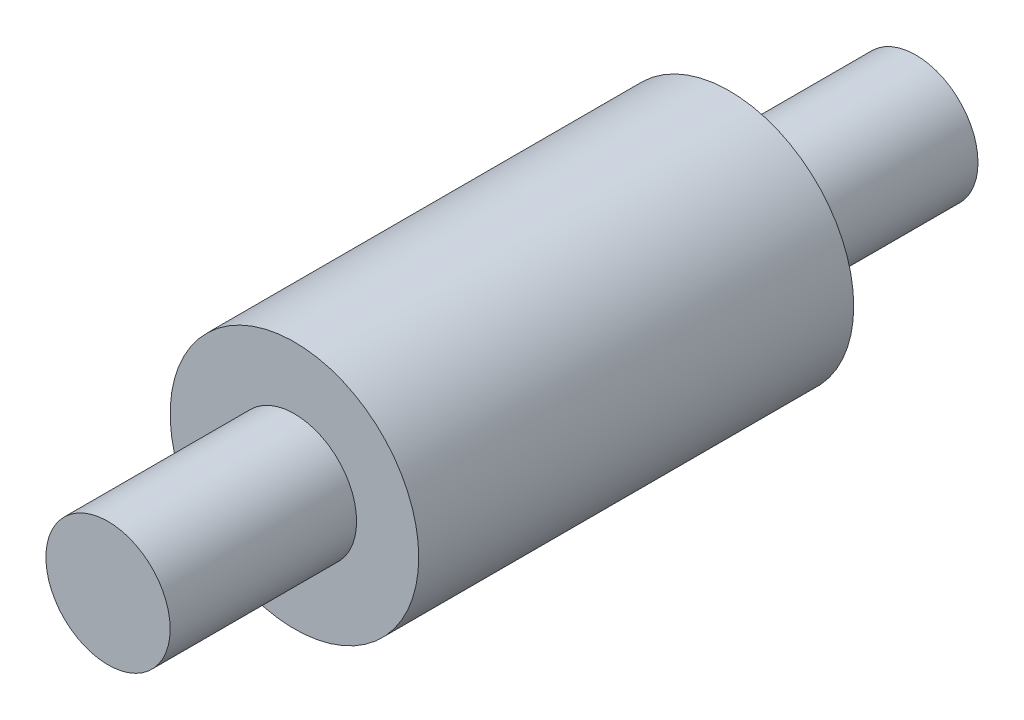
ISO-10303-21;
HEADER;
FILE_DESCRIPTION(('STEP AP214'),'2;1');
FILE_NAME('part.step','',(''),(''),'','','');
FILE_SCHEMA(('AUTOMOTIVE_DESIGN { 1 0 10303 214 1 1 1 1 }'));
ENDSEC;
DATA;
#1=APPLICATION_CONTEXT('core data for automotive mechanical design processes');
#2=APPLICATION_PROTOCOL_DEFINITION('international standard','automotive_design',2000,#1);
#3=PRODUCT_CONTEXT('',#1,'mechanical');
#4=PRODUCT('Part','Part','',(#3));
#5=PRODUCT_RELATED_PRODUCT_CATEGORY('part','',(#4));
#6=PRODUCT_DEFINITION_FORMATION('','',#4);
#7=PRODUCT_DEFINITION_CONTEXT('part definition',#1,'design');
#8=PRODUCT_DEFINITION('design','',#6,#7);
#9=PRODUCT_DEFINITION_SHAPE('','',#8);
#10=(LENGTH_UNIT() NAMED_UNIT(*) SI_UNIT(.MILLI.,.METRE.));
#11=(NAMED_UNIT(*) PLANE_ANGLE_UNIT() SI_UNIT($,.RADIAN.));
#12=(NAMED_UNIT(*) SI_UNIT($,.STERADIAN.) SOLID_ANGLE_UNIT());
#13=UNCERTAINTY_MEASURE_WITH_UNIT(LENGTH_MEASURE(1.E-05),#10,'distance_accuracy_value','');
#14=(GEOMETRIC_REPRESENTATION_CONTEXT(3) GLOBAL_UNCERTAINTY_ASSIGNED_CONTEXT((#13)) GLOBAL_UNIT_ASSIGNED_CONTEXT((#10,
#11,#12)) REPRESENTATION_CONTEXT('',''));
#15=CARTESIAN_POINT('',(0.,0.,0.));
#16=DIRECTION('',(0.,0.,1.));
#17=DIRECTION('',(1.,0.,0.));
#18=AXIS2_PLACEMENT_3D('',#15,#16,#17);
#19=CARTESIAN_POINT('',(0.,0.,0.));
#20=DIRECTION('',(0.,0.,-1.));
#21=DIRECTION('',(-1.,0.,0.));
#22=AXIS2_PLACEMENT_3D('',#19,#20,#21);
#23=PLANE('',#22);
#24=CARTESIAN_POINT('',(0.,0.,0.));
#25=DIRECTION('',(0.,0.,1.));
#26=DIRECTION('',(1.,0.,0.));
#27=AXIS2_PLACEMENT_3D('',#24,#25,#26);
#28=CIRCLE('',#27,10.);
#29=CARTESIAN_POINT('',(10.,0.,0.));
#30=VERTEX_POINT('',#29);
#31=EDGE_CURVE('E10',#30,#30,#28,.T.);
#32=ORIENTED_EDGE('',*,*,#31,.T.);
#33=EDGE_LOOP('',(#32));
#34=FACE_BOUND('',#33,.T.);
#35=ADVANCED_FACE('F31',(#34),#23,.F.);
#36=CARTESIAN_POINT('',(0.,0.,43.2423988439306));
#37=DIRECTION('',(0.,0.,1.));
#38=DIRECTION('',(1.,0.,0.));
#39=AXIS2_PLACEMENT_3D('',#36,#37,#38);
#40=CYLINDRICAL_SURFACE('',#39,10.);
#41=ORIENTED_EDGE('',*,*,#31,.F.);
#42=EDGE_LOOP('',(#41));
#43=FACE_BOUND('',#42,.T.);
#44=CARTESIAN_POINT('',(0.,0.,-30.));
#45=DIRECTION('',(0.,0.,1.));
#46=DIRECTION('',(1.,0.,0.));
#47=AXIS2_PLACEMENT_3D('',#44,#45,#46);
#48=CIRCLE('',#47,10.);
#49=CARTESIAN_POINT('',(10.,0.,-30.));
#50=VERTEX_POINT('',#49);
#51=EDGE_CURVE('E37',#50,#50,#48,.T.);
#52=ORIENTED_EDGE('',*,*,#51,.T.);
#53=EDGE_LOOP('',(#52));
#54=FACE_BOUND('',#53,.T.);
#55=ADVANCED_FACE('F69',(#43,#54),#40,.T.);
#56=CARTESIAN_POINT('',(0.,10.,-30.));
#57=DIRECTION('',(0.,0.,-1.));
#58=DIRECTION('',(-1.,0.,0.));
#59=AXIS2_PLACEMENT_3D('',#56,#57,#58);
#60=PLANE('',#59);
#61=ORIENTED_EDGE('',*,*,#51,.F.);
#62=EDGE_LOOP('',(#61));
#63=FACE_BOUND('',#62,.T.);
#64=CARTESIAN_POINT('',(0.,0.,-30.));
#65=DIRECTION('',(0.,0.,1.));
#66=DIRECTION('',(1.,0.,0.));
#67=AXIS2_PLACEMENT_3D('',#64,#65,#66);
#68=CIRCLE('',#67,20.);
#69=CARTESIAN_POINT('',(20.,0.,-30.));
#70=VERTEX_POINT('',#69);
#71=EDGE_CURVE('E41',#70,#70,#68,.T.);
#72=ORIENTED_EDGE('',*,*,#71,.T.);
#73=EDGE_LOOP('',(#72));
#74=FACE_BOUND('',#73,.T.);
#75=ADVANCED_FACE('F73',(#63,#74),#60,.F.);
#76=CARTESIAN_POINT('',(0.,0.,43.2423988439306));
#77=DIRECTION('',(0.,0.,1.));
#78=DIRECTION('',(1.,0.,0.));
#79=AXIS2_PLACEMENT_3D('',#76,#77,#78);
#80=CYLINDRICAL_SURFACE('',#79,20.);
#81=ORIENTED_EDGE('',*,*,#71,.F.);
#82=EDGE_LOOP('',(#81));
#83=FACE_BOUND('',#82,.T.);
#84=CARTESIAN_POINT('',(0.,0.,-100.));
#85=DIRECTION('',(0.,0.,1.));
#86=DIRECTION('',(1.,0.,0.));
#87=AXIS2_PLACEMENT_3D('',#84,#85,#86);
#88=CIRCLE('',#87,20.);
#89=CARTESIAN_POINT('',(20.,0.,-100.));
#90=VERTEX_POINT('',#89);
#91=EDGE_CURVE('E45',#90,#90,#88,.T.);
#92=ORIENTED_EDGE('',*,*,#91,.T.);
#93=EDGE_LOOP('',(#92));
#94=FACE_BOUND('',#93,.T.);
#95=ADVANCED_FACE('F78',(#83,#94),#80,.T.);
#96=CARTESIAN_POINT('',(0.,20.,-100.));
#97=DIRECTION('',(0.,0.,1.));
#98=DIRECTION('',(1.,0.,0.));
#99=AXIS2_PLACEMENT_3D('',#96,#97,#98);
#100=PLANE('',#99);
#101=ORIENTED_EDGE('',*,*,#91,.F.);
#102=EDGE_LOOP('',(#101));
#103=FACE_BOUND('',#102,.T.);
#104=CARTESIAN_POINT('',(0.,0.,-100.));
#105=DIRECTION('',(0.,0.,1.));
#106=DIRECTION('',(1.,0.,0.));
#107=AXIS2_PLACEMENT_3D('',#104,#105,#106);
#108=CIRCLE('',#107,10.);
#109=CARTESIAN_POINT('',(10.,0.,-100.));
#110=VERTEX_POINT('',#109);
#111=EDGE_CURVE('E50',#110,#110,#108,.T.);
#112=ORIENTED_EDGE('',*,*,#111,.T.);
#113=EDGE_LOOP('',(#112));
#114=FACE_BOUND('',#113,.T.);
#115=ADVANCED_FACE('F65',(#103,#114),#100,.F.);
#116=CARTESIAN_POINT('',(0.,0.,43.2423988439306));
#117=DIRECTION('',(0.,0.,1.));
#118=DIRECTION('',(1.,0.,0.));
#119=AXIS2_PLACEMENT_3D('',#116,#117,#118);
#120=CYLINDRICAL_SURFACE('',#119,10.);
#121=ORIENTED_EDGE('',*,*,#111,.F.);
#122=EDGE_LOOP('',(#121));
#123=FACE_BOUND('',#122,.T.);
#124=CARTESIAN_POINT('',(0.,0.,-130.));
#125=DIRECTION('',(0.,0.,1.));
#126=DIRECTION('',(1.,0.,0.));
#127=AXIS2_PLACEMENT_3D('',#124,#125,#126);
#128=CIRCLE('',#127,10.);
#129=CARTESIAN_POINT('',(10.,0.,-130.));
#130=VERTEX_POINT('',#129);
#131=EDGE_CURVE('E53',#130,#130,#128,.T.);
#132=ORIENTED_EDGE('',*,*,#131,.T.);
#133=EDGE_LOOP('',(#132));
#134=FACE_BOUND('',#133,.T.);
#135=ADVANCED_FACE('F57',(#123,#134),#120,.T.);
#136=CARTESIAN_POINT('',(0.,10.,-130.));
#137=DIRECTION('',(0.,0.,1.));
#138=DIRECTION('',(1.,0.,0.));
#139=AXIS2_PLACEMENT_3D('',#136,#137,#138);
#140=PLANE('',#139);
#141=ORIENTED_EDGE('',*,*,#131,.F.);
#142=EDGE_LOOP('',(#141));
#143=FACE_BOUND('',#142,.T.);
#144=ADVANCED_FACE('F59',(#143),#140,.F.);
#145=CLOSED_SHELL('',(#35,#55,#75,#95,#115,#135,#144));
#146=MANIFOLD_SOLID_BREP('B2',#145);
#147=ADVANCED_BREP_SHAPE_REPRESENTATION('',(#18,#146),#14);
#148=SHAPE_DEFINITION_REPRESENTATION(#9,#147);
ENDSEC;
END-ISO-10303-21;
